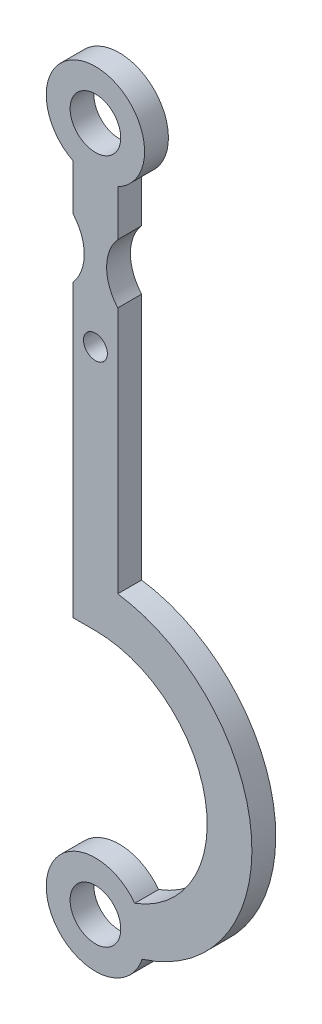
ISO-10303-21;
HEADER;
FILE_DESCRIPTION(('STEP AP214'),'2;1');
FILE_NAME('part.step','',(''),(''),'','','');
FILE_SCHEMA(('AUTOMOTIVE_DESIGN { 1 0 10303 214 1 1 1 1 }'));
ENDSEC;
DATA;
#1=APPLICATION_CONTEXT('core data for automotive mechanical design processes');
#2=APPLICATION_PROTOCOL_DEFINITION('international standard','automotive_design',2000,#1);
#3=PRODUCT_CONTEXT('',#1,'mechanical');
#4=PRODUCT('Part','Part','',(#3));
#5=PRODUCT_RELATED_PRODUCT_CATEGORY('part','',(#4));
#6=PRODUCT_DEFINITION_FORMATION('','',#4);
#7=PRODUCT_DEFINITION_CONTEXT('part definition',#1,'design');
#8=PRODUCT_DEFINITION('design','',#6,#7);
#9=PRODUCT_DEFINITION_SHAPE('','',#8);
#10=(LENGTH_UNIT() NAMED_UNIT(*) SI_UNIT(.MILLI.,.METRE.));
#11=(NAMED_UNIT(*) PLANE_ANGLE_UNIT() SI_UNIT($,.RADIAN.));
#12=(NAMED_UNIT(*) SI_UNIT($,.STERADIAN.) SOLID_ANGLE_UNIT());
#13=UNCERTAINTY_MEASURE_WITH_UNIT(LENGTH_MEASURE(1.E-05),#10,'distance_accuracy_value','');
#14=(GEOMETRIC_REPRESENTATION_CONTEXT(3) GLOBAL_UNCERTAINTY_ASSIGNED_CONTEXT((#13)) GLOBAL_UNIT_ASSIGNED_CONTEXT((#10,
#11,#12)) REPRESENTATION_CONTEXT('',''));
#15=CARTESIAN_POINT('',(0.,0.,0.));
#16=DIRECTION('',(0.,0.,1.));
#17=DIRECTION('',(1.,0.,0.));
#18=AXIS2_PLACEMENT_3D('',#15,#16,#17);
#19=CARTESIAN_POINT('',(0.,-230.,8.));
#20=DIRECTION('',(0.,0.,-1.));
#21=DIRECTION('',(-1.,0.,0.));
#22=AXIS2_PLACEMENT_3D('',#19,#20,#21);
#23=CYLINDRICAL_SURFACE('',#22,16.5);
#24=CARTESIAN_POINT('',(0.,-230.,0.));
#25=DIRECTION('',(0.,0.,1.));
#26=DIRECTION('',(1.,0.,0.));
#27=AXIS2_PLACEMENT_3D('',#24,#25,#26);
#28=CIRCLE('',#27,16.5);
#29=CARTESIAN_POINT('',(13.2109217570533,-220.114579102081,0.));
#30=VERTEX_POINT('',#29);
#31=CARTESIAN_POINT('',(15.6853883518442,-235.120409383226,0.));
#32=VERTEX_POINT('',#31);
#33=EDGE_CURVE('E181',#30,#32,#28,.T.);
#34=ORIENTED_EDGE('',*,*,#33,.T.);
#35=DIRECTION('',(0.,0.,-1.));
#36=VECTOR('',#35,1.);
#37=CARTESIAN_POINT('',(15.6853883518442,-235.120409383226,8.));
#38=LINE('',#37,#36);
#39=CARTESIAN_POINT('',(15.6853883518442,-235.120409383226,8.));
#40=VERTEX_POINT('',#39);
#41=EDGE_CURVE('E11',#40,#32,#38,.T.);
#42=ORIENTED_EDGE('',*,*,#41,.F.);
#43=CARTESIAN_POINT('',(0.,-230.,8.));
#44=DIRECTION('',(0.,0.,1.));
#45=DIRECTION('',(1.,0.,0.));
#46=AXIS2_PLACEMENT_3D('',#43,#44,#45);
#47=CIRCLE('',#46,16.5);
#48=CARTESIAN_POINT('',(13.2109217570533,-220.114579102081,8.));
#49=VERTEX_POINT('',#48);
#50=EDGE_CURVE('E268',#49,#40,#47,.T.);
#51=ORIENTED_EDGE('',*,*,#50,.F.);
#52=DIRECTION('',(0.,0.,-1.));
#53=VECTOR('',#52,1.);
#54=CARTESIAN_POINT('',(13.2109217570533,-220.114579102081,8.));
#55=LINE('',#54,#53);
#56=EDGE_CURVE('E165',#49,#30,#55,.T.);
#57=ORIENTED_EDGE('',*,*,#56,.T.);
#58=EDGE_LOOP('',(#34,#42,#51,#57));
#59=FACE_BOUND('',#58,.T.);
#60=ADVANCED_FACE('F47',(#59),#23,.T.);
#61=CARTESIAN_POINT('',(0.,-185.,8.));
#62=DIRECTION('',(0.,0.,-1.));
#63=DIRECTION('',(-1.,0.,0.));
#64=AXIS2_PLACEMENT_3D('',#61,#62,#63);
#65=CYLINDRICAL_SURFACE('',#64,52.5174908434357);
#66=CARTESIAN_POINT('',(0.,-185.,0.));
#67=DIRECTION('',(0.,0.,1.));
#68=DIRECTION('',(1.,0.,0.));
#69=AXIS2_PLACEMENT_3D('',#66,#67,#68);
#70=CIRCLE('',#69,52.5174908434357);
#71=CARTESIAN_POINT('',(7.50000000000002,-133.020803733702,0.));
#72=VERTEX_POINT('',#71);
#73=EDGE_CURVE('E185',#32,#72,#70,.T.);
#74=ORIENTED_EDGE('',*,*,#73,.T.);
#75=DIRECTION('',(0.,0.,-1.));
#76=VECTOR('',#75,1.);
#77=CARTESIAN_POINT('',(7.50000000000002,-133.020803733702,8.));
#78=LINE('',#77,#76);
#79=CARTESIAN_POINT('',(7.50000000000002,-133.020803733702,8.));
#80=VERTEX_POINT('',#79);
#81=EDGE_CURVE('E57',#80,#72,#78,.T.);
#82=ORIENTED_EDGE('',*,*,#81,.F.);
#83=CARTESIAN_POINT('',(0.,-185.,8.));
#84=DIRECTION('',(0.,0.,1.));
#85=DIRECTION('',(1.,0.,0.));
#86=AXIS2_PLACEMENT_3D('',#83,#84,#85);
#87=CIRCLE('',#86,52.5174908434357);
#88=EDGE_CURVE('E113',#40,#80,#87,.T.);
#89=ORIENTED_EDGE('',*,*,#88,.F.);
#90=ORIENTED_EDGE('',*,*,#41,.T.);
#91=EDGE_LOOP('',(#74,#82,#89,#90));
#92=FACE_BOUND('',#91,.T.);
#93=ADVANCED_FACE('F248',(#92),#65,.T.);
#94=CARTESIAN_POINT('',(7.50000000000001,0.,8.));
#95=DIRECTION('',(1.,0.,0.));
#96=DIRECTION('',(0.,1.,0.));
#97=AXIS2_PLACEMENT_3D('',#94,#95,#96);
#98=PLANE('',#97);
#99=DIRECTION('',(0.,-1.,0.));
#100=VECTOR('',#99,1.);
#101=CARTESIAN_POINT('',(7.50000000000001,0.,0.));
#102=LINE('',#101,#100);
#103=CARTESIAN_POINT('',(7.50000000000001,-49.9215674164922,0.));
#104=VERTEX_POINT('',#103);
#105=EDGE_CURVE('E189',#104,#72,#102,.T.);
#106=ORIENTED_EDGE('',*,*,#105,.F.);
#107=DIRECTION('',(0.,0.,-1.));
#108=VECTOR('',#107,1.);
#109=CARTESIAN_POINT('',(7.50000000000001,-49.9215674164922,8.));
#110=LINE('',#109,#108);
#111=CARTESIAN_POINT('',(7.50000000000001,-49.9215674164922,8.));
#112=VERTEX_POINT('',#111);
#113=EDGE_CURVE('E237',#112,#104,#110,.T.);
#114=ORIENTED_EDGE('',*,*,#113,.F.);
#115=DIRECTION('',(0.,-1.,0.));
#116=VECTOR('',#115,1.);
#117=CARTESIAN_POINT('',(7.50000000000001,0.,8.));
#118=LINE('',#117,#116);
#119=EDGE_CURVE('E247',#112,#80,#118,.T.);
#120=ORIENTED_EDGE('',*,*,#119,.T.);
#121=ORIENTED_EDGE('',*,*,#81,.T.);
#122=EDGE_LOOP('',(#106,#114,#120,#121));
#123=FACE_BOUND('',#122,.T.);
#124=ADVANCED_FACE('F245',(#123),#98,.T.);
#125=CARTESIAN_POINT('',(18.75,-40.,8.));
#126=DIRECTION('',(0.,0.,-1.));
#127=DIRECTION('',(-1.,0.,0.));
#128=AXIS2_PLACEMENT_3D('',#125,#126,#127);
#129=CYLINDRICAL_SURFACE('',#128,15.);
#130=CARTESIAN_POINT('',(18.75,-40.,0.));
#131=DIRECTION('',(0.,0.,1.));
#132=DIRECTION('',(1.,0.,0.));
#133=AXIS2_PLACEMENT_3D('',#130,#131,#132);
#134=CIRCLE('',#133,15.);
#135=CARTESIAN_POINT('',(7.50000000000001,-30.0784325835078,0.));
#136=VERTEX_POINT('',#135);
#137=EDGE_CURVE('E193',#136,#104,#134,.T.);
#138=ORIENTED_EDGE('',*,*,#137,.F.);
#139=DIRECTION('',(0.,0.,-1.));
#140=VECTOR('',#139,1.);
#141=CARTESIAN_POINT('',(7.50000000000001,-30.0784325835078,8.));
#142=LINE('',#141,#140);
#143=CARTESIAN_POINT('',(7.50000000000001,-30.0784325835078,8.));
#144=VERTEX_POINT('',#143);
#145=EDGE_CURVE('E234',#144,#136,#142,.T.);
#146=ORIENTED_EDGE('',*,*,#145,.F.);
#147=CARTESIAN_POINT('',(18.75,-40.,8.));
#148=DIRECTION('',(0.,0.,1.));
#149=DIRECTION('',(1.,0.,0.));
#150=AXIS2_PLACEMENT_3D('',#147,#148,#149);
#151=CIRCLE('',#150,15.);
#152=EDGE_CURVE('E259',#144,#112,#151,.T.);
#153=ORIENTED_EDGE('',*,*,#152,.T.);
#154=ORIENTED_EDGE('',*,*,#113,.T.);
#155=EDGE_LOOP('',(#138,#146,#153,#154));
#156=FACE_BOUND('',#155,.T.);
#157=ADVANCED_FACE('F256',(#156),#129,.F.);
#158=CARTESIAN_POINT('',(7.49999999999999,0.,8.));
#159=DIRECTION('',(1.,0.,0.));
#160=DIRECTION('',(0.,1.,0.));
#161=AXIS2_PLACEMENT_3D('',#158,#159,#160);
#162=PLANE('',#161);
#163=DIRECTION('',(0.,-1.,0.));
#164=VECTOR('',#163,1.);
#165=CARTESIAN_POINT('',(7.49999999999999,0.,0.));
#166=LINE('',#165,#164);
#167=CARTESIAN_POINT('',(7.5,-14.6969384566991,0.));
#168=VERTEX_POINT('',#167);
#169=EDGE_CURVE('E197',#168,#136,#166,.T.);
#170=ORIENTED_EDGE('',*,*,#169,.F.);
#171=DIRECTION('',(0.,0.,-1.));
#172=VECTOR('',#171,1.);
#173=CARTESIAN_POINT('',(7.5,-14.6969384566991,8.));
#174=LINE('',#173,#172);
#175=CARTESIAN_POINT('',(7.5,-14.6969384566991,8.));
#176=VERTEX_POINT('',#175);
#177=EDGE_CURVE('E231',#176,#168,#174,.T.);
#178=ORIENTED_EDGE('',*,*,#177,.F.);
#179=DIRECTION('',(0.,-1.,0.));
#180=VECTOR('',#179,1.);
#181=CARTESIAN_POINT('',(7.49999999999999,0.,8.));
#182=LINE('',#181,#180);
#183=EDGE_CURVE('E266',#176,#144,#182,.T.);
#184=ORIENTED_EDGE('',*,*,#183,.T.);
#185=ORIENTED_EDGE('',*,*,#145,.T.);
#186=EDGE_LOOP('',(#170,#178,#184,#185));
#187=FACE_BOUND('',#186,.T.);
#188=ADVANCED_FACE('F428',(#187),#162,.T.);
#189=CARTESIAN_POINT('',(0.,0.,8.));
#190=DIRECTION('',(0.,0.,-1.));
#191=DIRECTION('',(-1.,0.,0.));
#192=AXIS2_PLACEMENT_3D('',#189,#190,#191);
#193=CYLINDRICAL_SURFACE('',#192,16.5);
#194=CARTESIAN_POINT('',(0.,0.,0.));
#195=DIRECTION('',(0.,0.,1.));
#196=DIRECTION('',(1.,0.,0.));
#197=AXIS2_PLACEMENT_3D('',#194,#195,#196);
#198=CIRCLE('',#197,16.5);
#199=CARTESIAN_POINT('',(-7.5,-14.6969384566991,0.));
#200=VERTEX_POINT('',#199);
#201=EDGE_CURVE('E201',#200,#168,#198,.F.);
#202=ORIENTED_EDGE('',*,*,#201,.F.);
#203=DIRECTION('',(0.,0.,-1.));
#204=VECTOR('',#203,1.);
#205=CARTESIAN_POINT('',(-7.5,-14.6969384566991,8.));
#206=LINE('',#205,#204);
#207=CARTESIAN_POINT('',(-7.5,-14.6969384566991,8.));
#208=VERTEX_POINT('',#207);
#209=EDGE_CURVE('E228',#208,#200,#206,.T.);
#210=ORIENTED_EDGE('',*,*,#209,.F.);
#211=CARTESIAN_POINT('',(0.,0.,8.));
#212=DIRECTION('',(0.,0.,1.));
#213=DIRECTION('',(1.,0.,0.));
#214=AXIS2_PLACEMENT_3D('',#211,#212,#213);
#215=CIRCLE('',#214,16.5);
#216=EDGE_CURVE('E274',#208,#176,#215,.F.);
#217=ORIENTED_EDGE('',*,*,#216,.T.);
#218=ORIENTED_EDGE('',*,*,#177,.T.);
#219=EDGE_LOOP('',(#202,#210,#217,#218));
#220=FACE_BOUND('',#219,.T.);
#221=ADVANCED_FACE('F420',(#220),#193,.T.);
#222=CARTESIAN_POINT('',(-7.49999999999999,0.,8.));
#223=DIRECTION('',(1.,0.,0.));
#224=DIRECTION('',(0.,1.,0.));
#225=AXIS2_PLACEMENT_3D('',#222,#223,#224);
#226=PLANE('',#225);
#227=DIRECTION('',(0.,-1.,0.));
#228=VECTOR('',#227,1.);
#229=CARTESIAN_POINT('',(-7.49999999999999,0.,0.));
#230=LINE('',#229,#228);
#231=CARTESIAN_POINT('',(-7.50000000000001,-30.0784325835078,0.));
#232=VERTEX_POINT('',#231);
#233=EDGE_CURVE('E205',#200,#232,#230,.T.);
#234=ORIENTED_EDGE('',*,*,#233,.T.);
#235=DIRECTION('',(0.,0.,-1.));
#236=VECTOR('',#235,1.);
#237=CARTESIAN_POINT('',(-7.50000000000001,-30.0784325835078,8.));
#238=LINE('',#237,#236);
#239=CARTESIAN_POINT('',(-7.50000000000001,-30.0784325835078,8.));
#240=VERTEX_POINT('',#239);
#241=EDGE_CURVE('E224',#240,#232,#238,.T.);
#242=ORIENTED_EDGE('',*,*,#241,.F.);
#243=DIRECTION('',(0.,-1.,0.));
#244=VECTOR('',#243,1.);
#245=CARTESIAN_POINT('',(-7.49999999999999,0.,8.));
#246=LINE('',#245,#244);
#247=EDGE_CURVE('E278',#208,#240,#246,.T.);
#248=ORIENTED_EDGE('',*,*,#247,.F.);
#249=ORIENTED_EDGE('',*,*,#209,.T.);
#250=EDGE_LOOP('',(#234,#242,#248,#249));
#251=FACE_BOUND('',#250,.T.);
#252=ADVANCED_FACE('F305',(#251),#226,.F.);
#253=CARTESIAN_POINT('',(-18.75,-40.,8.));
#254=DIRECTION('',(0.,0.,-1.));
#255=DIRECTION('',(-1.,0.,0.));
#256=AXIS2_PLACEMENT_3D('',#253,#254,#255);
#257=CYLINDRICAL_SURFACE('',#256,15.);
#258=CARTESIAN_POINT('',(-18.75,-40.,0.));
#259=DIRECTION('',(0.,0.,1.));
#260=DIRECTION('',(1.,0.,0.));
#261=AXIS2_PLACEMENT_3D('',#258,#259,#260);
#262=CIRCLE('',#261,15.);
#263=CARTESIAN_POINT('',(-7.50000000000001,-49.9215674164922,0.));
#264=VERTEX_POINT('',#263);
#265=EDGE_CURVE('E208',#232,#264,#262,.F.);
#266=ORIENTED_EDGE('',*,*,#265,.T.);
#267=DIRECTION('',(0.,0.,-1.));
#268=VECTOR('',#267,1.);
#269=CARTESIAN_POINT('',(-7.50000000000001,-49.9215674164922,8.));
#270=LINE('',#269,#268);
#271=CARTESIAN_POINT('',(-7.50000000000001,-49.9215674164922,8.));
#272=VERTEX_POINT('',#271);
#273=EDGE_CURVE('E156',#272,#264,#270,.T.);
#274=ORIENTED_EDGE('',*,*,#273,.F.);
#275=CARTESIAN_POINT('',(-18.75,-40.,8.));
#276=DIRECTION('',(0.,0.,1.));
#277=DIRECTION('',(1.,0.,0.));
#278=AXIS2_PLACEMENT_3D('',#275,#276,#277);
#279=CIRCLE('',#278,15.);
#280=EDGE_CURVE('E141',#240,#272,#279,.F.);
#281=ORIENTED_EDGE('',*,*,#280,.F.);
#282=ORIENTED_EDGE('',*,*,#241,.T.);
#283=EDGE_LOOP('',(#266,#274,#281,#282));
#284=FACE_BOUND('',#283,.T.);
#285=ADVANCED_FACE('F309',(#284),#257,.F.);
#286=CARTESIAN_POINT('',(-7.50000000000001,0.,8.));
#287=DIRECTION('',(1.,0.,0.));
#288=DIRECTION('',(0.,1.,0.));
#289=AXIS2_PLACEMENT_3D('',#286,#287,#288);
#290=PLANE('',#289);
#291=DIRECTION('',(0.,-1.,0.));
#292=VECTOR('',#291,1.);
#293=CARTESIAN_POINT('',(-7.50000000000001,0.,0.));
#294=LINE('',#293,#292);
#295=CARTESIAN_POINT('',(-7.49999999999999,-147.482509156564,0.));
#296=VERTEX_POINT('',#295);
#297=EDGE_CURVE('E151',#264,#296,#294,.T.);
#298=ORIENTED_EDGE('',*,*,#297,.T.);
#299=DIRECTION('',(0.,0.,-1.));
#300=VECTOR('',#299,1.);
#301=CARTESIAN_POINT('',(-7.49999999999999,-147.482509156564,8.));
#302=LINE('',#301,#300);
#303=CARTESIAN_POINT('',(-7.49999999999999,-147.482509156564,8.));
#304=VERTEX_POINT('',#303);
#305=EDGE_CURVE('E148',#304,#296,#302,.T.);
#306=ORIENTED_EDGE('',*,*,#305,.F.);
#307=DIRECTION('',(0.,-1.,0.));
#308=VECTOR('',#307,1.);
#309=CARTESIAN_POINT('',(-7.50000000000001,0.,8.));
#310=LINE('',#309,#308);
#311=EDGE_CURVE('E135',#272,#304,#310,.T.);
#312=ORIENTED_EDGE('',*,*,#311,.F.);
#313=ORIENTED_EDGE('',*,*,#273,.T.);
#314=EDGE_LOOP('',(#298,#306,#312,#313));
#315=FACE_BOUND('',#314,.T.);
#316=ADVANCED_FACE('F149',(#315),#290,.F.);
#317=CARTESIAN_POINT('',(0.,-147.482509156564,8.));
#318=DIRECTION('',(0.,-1.,0.));
#319=DIRECTION('',(0.,0.,-1.));
#320=AXIS2_PLACEMENT_3D('',#317,#318,#319);
#321=PLANE('',#320);
#322=DIRECTION('',(-1.,0.,0.));
#323=VECTOR('',#322,1.);
#324=CARTESIAN_POINT('',(0.,-147.482509156564,0.));
#325=LINE('',#324,#323);
#326=CARTESIAN_POINT('',(0.,-147.482509156564,0.));
#327=VERTEX_POINT('',#326);
#328=EDGE_CURVE('E213',#327,#296,#325,.T.);
#329=ORIENTED_EDGE('',*,*,#328,.F.);
#330=DIRECTION('',(0.,0.,-1.));
#331=VECTOR('',#330,1.);
#332=CARTESIAN_POINT('',(0.,-147.482509156564,8.));
#333=LINE('',#332,#331);
#334=CARTESIAN_POINT('',(0.,-147.482509156564,8.));
#335=VERTEX_POINT('',#334);
#336=EDGE_CURVE('E102',#335,#327,#333,.T.);
#337=ORIENTED_EDGE('',*,*,#336,.F.);
#338=DIRECTION('',(-1.,0.,0.));
#339=VECTOR('',#338,1.);
#340=CARTESIAN_POINT('',(0.,-147.482509156564,8.));
#341=LINE('',#340,#339);
#342=EDGE_CURVE('E139',#335,#304,#341,.T.);
#343=ORIENTED_EDGE('',*,*,#342,.T.);
#344=ORIENTED_EDGE('',*,*,#305,.T.);
#345=EDGE_LOOP('',(#329,#337,#343,#344));
#346=FACE_BOUND('',#345,.T.);
#347=ADVANCED_FACE('F158',(#346),#321,.T.);
#348=CARTESIAN_POINT('',(0.,0.,8.));
#349=DIRECTION('',(0.,0.,-1.));
#350=DIRECTION('',(-1.,0.,0.));
#351=AXIS2_PLACEMENT_3D('',#348,#349,#350);
#352=CYLINDRICAL_SURFACE('',#351,8.5);
#353=CARTESIAN_POINT('',(0.,0.,8.));
#354=DIRECTION('',(0.,0.,1.));
#355=DIRECTION('',(1.,0.,0.));
#356=AXIS2_PLACEMENT_3D('',#353,#354,#355);
#357=CIRCLE('',#356,8.5);
#358=CARTESIAN_POINT('',(8.5,0.,8.));
#359=VERTEX_POINT('',#358);
#360=EDGE_CURVE('E476',#359,#359,#357,.T.);
#361=ORIENTED_EDGE('',*,*,#360,.T.);
#362=EDGE_LOOP('',(#361));
#363=FACE_BOUND('',#362,.T.);
#364=CARTESIAN_POINT('',(0.,0.,0.));
#365=DIRECTION('',(0.,0.,1.));
#366=DIRECTION('',(1.,0.,0.));
#367=AXIS2_PLACEMENT_3D('',#364,#365,#366);
#368=CIRCLE('',#367,8.5);
#369=CARTESIAN_POINT('',(8.5,0.,0.));
#370=VERTEX_POINT('',#369);
#371=EDGE_CURVE('E177',#370,#370,#368,.T.);
#372=ORIENTED_EDGE('',*,*,#371,.F.);
#373=EDGE_LOOP('',(#372));
#374=FACE_BOUND('',#373,.T.);
#375=ADVANCED_FACE('F333',(#363,#374),#352,.F.);
#376=CARTESIAN_POINT('',(0.,-230.,8.));
#377=DIRECTION('',(0.,0.,-1.));
#378=DIRECTION('',(-1.,0.,0.));
#379=AXIS2_PLACEMENT_3D('',#376,#377,#378);
#380=CYLINDRICAL_SURFACE('',#379,8.50000000000001);
#381=CARTESIAN_POINT('',(0.,-230.,8.));
#382=DIRECTION('',(0.,0.,1.));
#383=DIRECTION('',(1.,0.,0.));
#384=AXIS2_PLACEMENT_3D('',#381,#382,#383);
#385=CIRCLE('',#384,8.50000000000001);
#386=CARTESIAN_POINT('',(8.50000000000001,-230.,8.));
#387=VERTEX_POINT('',#386);
#388=EDGE_CURVE('E343',#387,#387,#385,.T.);
#389=ORIENTED_EDGE('',*,*,#388,.T.);
#390=EDGE_LOOP('',(#389));
#391=FACE_BOUND('',#390,.T.);
#392=CARTESIAN_POINT('',(0.,-230.,0.));
#393=DIRECTION('',(0.,0.,1.));
#394=DIRECTION('',(1.,0.,0.));
#395=AXIS2_PLACEMENT_3D('',#392,#393,#394);
#396=CIRCLE('',#395,8.50000000000001);
#397=CARTESIAN_POINT('',(8.50000000000001,-230.,0.));
#398=VERTEX_POINT('',#397);
#399=EDGE_CURVE('E173',#398,#398,#396,.T.);
#400=ORIENTED_EDGE('',*,*,#399,.F.);
#401=EDGE_LOOP('',(#400));
#402=FACE_BOUND('',#401,.T.);
#403=ADVANCED_FACE('F321',(#391,#402),#380,.F.);
#404=CARTESIAN_POINT('',(0.,-65.,8.));
#405=DIRECTION('',(0.,0.,-1.));
#406=DIRECTION('',(-1.,0.,0.));
#407=AXIS2_PLACEMENT_3D('',#404,#405,#406);
#408=CYLINDRICAL_SURFACE('',#407,4.);
#409=CARTESIAN_POINT('',(0.,-65.,8.));
#410=DIRECTION('',(0.,0.,1.));
#411=DIRECTION('',(1.,0.,0.));
#412=AXIS2_PLACEMENT_3D('',#409,#410,#411);
#413=CIRCLE('',#412,4.);
#414=CARTESIAN_POINT('',(4.,-65.,8.));
#415=VERTEX_POINT('',#414);
#416=EDGE_CURVE('E218',#415,#415,#413,.T.);
#417=ORIENTED_EDGE('',*,*,#416,.T.);
#418=EDGE_LOOP('',(#417));
#419=FACE_BOUND('',#418,.T.);
#420=CARTESIAN_POINT('',(0.,-65.,0.));
#421=DIRECTION('',(0.,0.,1.));
#422=DIRECTION('',(1.,0.,0.));
#423=AXIS2_PLACEMENT_3D('',#420,#421,#422);
#424=CIRCLE('',#423,4.);
#425=CARTESIAN_POINT('',(4.,-65.,0.));
#426=VERTEX_POINT('',#425);
#427=EDGE_CURVE('E169',#426,#426,#424,.T.);
#428=ORIENTED_EDGE('',*,*,#427,.F.);
#429=EDGE_LOOP('',(#428));
#430=FACE_BOUND('',#429,.T.);
#431=ADVANCED_FACE('F49',(#419,#430),#408,.F.);
#432=CARTESIAN_POINT('',(0.,-185.,8.));
#433=DIRECTION('',(0.,0.,-1.));
#434=DIRECTION('',(-1.,0.,0.));
#435=AXIS2_PLACEMENT_3D('',#432,#433,#434);
#436=CYLINDRICAL_SURFACE('',#435,37.5174908434357);
#437=CARTESIAN_POINT('',(0.,-185.,0.));
#438=DIRECTION('',(0.,0.,1.));
#439=DIRECTION('',(1.,0.,0.));
#440=AXIS2_PLACEMENT_3D('',#437,#438,#439);
#441=CIRCLE('',#440,37.5174908434357);
#442=EDGE_CURVE('E105',#327,#30,#441,.F.);
#443=ORIENTED_EDGE('',*,*,#442,.T.);
#444=ORIENTED_EDGE('',*,*,#56,.F.);
#445=CARTESIAN_POINT('',(0.,-185.,8.));
#446=DIRECTION('',(0.,0.,1.));
#447=DIRECTION('',(1.,0.,0.));
#448=AXIS2_PLACEMENT_3D('',#445,#446,#447);
#449=CIRCLE('',#448,37.5174908434357);
#450=EDGE_CURVE('E65',#335,#49,#449,.F.);
#451=ORIENTED_EDGE('',*,*,#450,.F.);
#452=ORIENTED_EDGE('',*,*,#336,.T.);
#453=EDGE_LOOP('',(#443,#444,#451,#452));
#454=FACE_BOUND('',#453,.T.);
#455=ADVANCED_FACE('F312',(#454),#436,.F.);
#456=CARTESIAN_POINT('',(0.,0.,8.));
#457=DIRECTION('',(0.,0.,1.));
#458=DIRECTION('',(1.,0.,0.));
#459=AXIS2_PLACEMENT_3D('',#456,#457,#458);
#460=PLANE('',#459);
#461=ORIENTED_EDGE('',*,*,#416,.F.);
#462=EDGE_LOOP('',(#461));
#463=FACE_BOUND('',#462,.T.);
#464=ORIENTED_EDGE('',*,*,#388,.F.);
#465=EDGE_LOOP('',(#464));
#466=FACE_BOUND('',#465,.T.);
#467=ORIENTED_EDGE('',*,*,#360,.F.);
#468=EDGE_LOOP('',(#467));
#469=FACE_BOUND('',#468,.T.);
#470=ORIENTED_EDGE('',*,*,#50,.T.);
#471=ORIENTED_EDGE('',*,*,#88,.T.);
#472=ORIENTED_EDGE('',*,*,#119,.F.);
#473=ORIENTED_EDGE('',*,*,#152,.F.);
#474=ORIENTED_EDGE('',*,*,#183,.F.);
#475=ORIENTED_EDGE('',*,*,#216,.F.);
#476=ORIENTED_EDGE('',*,*,#247,.T.);
#477=ORIENTED_EDGE('',*,*,#280,.T.);
#478=ORIENTED_EDGE('',*,*,#311,.T.);
#479=ORIENTED_EDGE('',*,*,#342,.F.);
#480=ORIENTED_EDGE('',*,*,#450,.T.);
#481=EDGE_LOOP('',(#470,#471,#472,#473,#474,#475,#476,#477,#478,#479,#480));
#482=FACE_BOUND('',#481,.T.);
#483=ADVANCED_FACE('F137',(#463,#466,#469,#482),#460,.T.);
#484=CARTESIAN_POINT('',(0.,0.,0.));
#485=DIRECTION('',(0.,0.,1.));
#486=DIRECTION('',(1.,0.,0.));
#487=AXIS2_PLACEMENT_3D('',#484,#485,#486);
#488=PLANE('',#487);
#489=ORIENTED_EDGE('',*,*,#427,.T.);
#490=EDGE_LOOP('',(#489));
#491=FACE_BOUND('',#490,.T.);
#492=ORIENTED_EDGE('',*,*,#399,.T.);
#493=EDGE_LOOP('',(#492));
#494=FACE_BOUND('',#493,.T.);
#495=ORIENTED_EDGE('',*,*,#371,.T.);
#496=EDGE_LOOP('',(#495));
#497=FACE_BOUND('',#496,.T.);
#498=ORIENTED_EDGE('',*,*,#33,.F.);
#499=ORIENTED_EDGE('',*,*,#442,.F.);
#500=ORIENTED_EDGE('',*,*,#328,.T.);
#501=ORIENTED_EDGE('',*,*,#297,.F.);
#502=ORIENTED_EDGE('',*,*,#265,.F.);
#503=ORIENTED_EDGE('',*,*,#233,.F.);
#504=ORIENTED_EDGE('',*,*,#201,.T.);
#505=ORIENTED_EDGE('',*,*,#169,.T.);
#506=ORIENTED_EDGE('',*,*,#137,.T.);
#507=ORIENTED_EDGE('',*,*,#105,.T.);
#508=ORIENTED_EDGE('',*,*,#73,.F.);
#509=EDGE_LOOP('',(#498,#499,#500,#501,#502,#503,#504,#505,#506,#507,#508));
#510=FACE_BOUND('',#509,.T.);
#511=ADVANCED_FACE('F252',(#491,#494,#497,#510),#488,.F.);
#512=CLOSED_SHELL('',(#60,#93,#124,#157,#188,#221,#252,#285,#316,#347,#375,#403,#431,#455,#483,#511));
#513=MANIFOLD_SOLID_BREP('B2',#512);
#514=ADVANCED_BREP_SHAPE_REPRESENTATION('',(#18,#513),#14);
#515=SHAPE_DEFINITION_REPRESENTATION(#9,#514);
ENDSEC;
END-ISO-10303-21;
